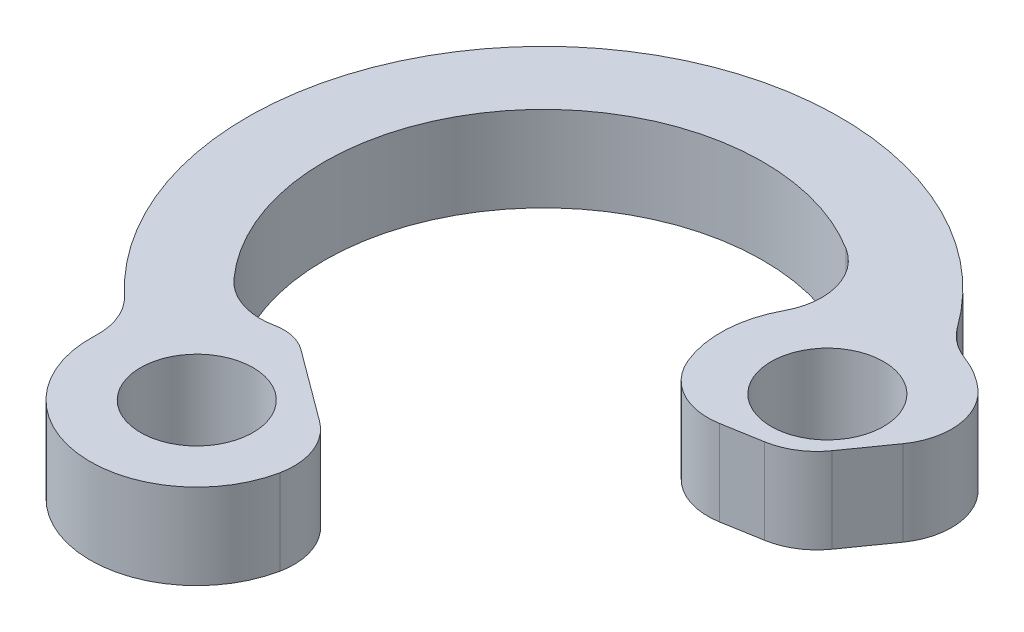
ISO-10303-21;
HEADER;
FILE_DESCRIPTION(('STEP AP214'),'2;1');
FILE_NAME('part.step','',(''),(''),'','','');
FILE_SCHEMA(('AUTOMOTIVE_DESIGN { 1 0 10303 214 1 1 1 1 }'));
ENDSEC;
DATA;
#1=APPLICATION_CONTEXT('core data for automotive mechanical design processes');
#2=APPLICATION_PROTOCOL_DEFINITION('international standard','automotive_design',2000,#1);
#3=PRODUCT_CONTEXT('',#1,'mechanical');
#4=PRODUCT('Part','Part','',(#3));
#5=PRODUCT_RELATED_PRODUCT_CATEGORY('part','',(#4));
#6=PRODUCT_DEFINITION_FORMATION('','',#4);
#7=PRODUCT_DEFINITION_CONTEXT('part definition',#1,'design');
#8=PRODUCT_DEFINITION('design','',#6,#7);
#9=PRODUCT_DEFINITION_SHAPE('','',#8);
#10=(LENGTH_UNIT() NAMED_UNIT(*) SI_UNIT(.MILLI.,.METRE.));
#11=(NAMED_UNIT(*) PLANE_ANGLE_UNIT() SI_UNIT($,.RADIAN.));
#12=(NAMED_UNIT(*) SI_UNIT($,.STERADIAN.) SOLID_ANGLE_UNIT());
#13=UNCERTAINTY_MEASURE_WITH_UNIT(LENGTH_MEASURE(1.E-05),#10,'distance_accuracy_value','');
#14=(GEOMETRIC_REPRESENTATION_CONTEXT(3) GLOBAL_UNCERTAINTY_ASSIGNED_CONTEXT((#13)) GLOBAL_UNIT_ASSIGNED_CONTEXT((#10,
#11,#12)) REPRESENTATION_CONTEXT('',''));
#15=CARTESIAN_POINT('',(0.,0.,0.));
#16=DIRECTION('',(0.,0.,1.));
#17=DIRECTION('',(1.,0.,0.));
#18=AXIS2_PLACEMENT_3D('',#15,#16,#17);
#19=CARTESIAN_POINT('',(70.7257143841729,0.,-73.8122286185501));
#20=DIRECTION('',(0.,1.,0.));
#21=DIRECTION('',(0.,0.,1.));
#22=AXIS2_PLACEMENT_3D('',#19,#20,#21);
#23=CYLINDRICAL_SURFACE('',#22,3.);
#24=CARTESIAN_POINT('',(70.7257143841729,4.,-73.8122286185501));
#25=DIRECTION('',(0.,-1.,0.));
#26=DIRECTION('',(0.,0.,-1.));
#27=AXIS2_PLACEMENT_3D('',#24,#25,#26);
#28=CIRCLE('',#27,3.);
#29=CARTESIAN_POINT('',(71.3263935959705,4.,-70.872979652485));
#30=VERTEX_POINT('',#29);
#31=CARTESIAN_POINT('',(68.4970170332679,4.,-71.8040184407876));
#32=VERTEX_POINT('',#31);
#33=EDGE_CURVE('E183',#30,#32,#28,.T.);
#34=ORIENTED_EDGE('',*,*,#33,.F.);
#35=DIRECTION('',(0.,1.,0.));
#36=VECTOR('',#35,1.);
#37=CARTESIAN_POINT('',(71.3263935959705,0.,-70.872979652485));
#38=LINE('',#37,#36);
#39=CARTESIAN_POINT('',(71.3263935959705,0.,-70.872979652485));
#40=VERTEX_POINT('',#39);
#41=EDGE_CURVE('E11',#40,#30,#38,.T.);
#42=ORIENTED_EDGE('',*,*,#41,.F.);
#43=CARTESIAN_POINT('',(70.7257143841729,0.,-73.8122286185501));
#44=DIRECTION('',(0.,-1.,0.));
#45=DIRECTION('',(0.,0.,-1.));
#46=AXIS2_PLACEMENT_3D('',#43,#44,#45);
#47=CIRCLE('',#46,3.);
#48=CARTESIAN_POINT('',(68.4970170332679,0.,-71.8040184407876));
#49=VERTEX_POINT('',#48);
#50=EDGE_CURVE('E231',#40,#49,#47,.T.);
#51=ORIENTED_EDGE('',*,*,#50,.T.);
#52=DIRECTION('',(0.,1.,0.));
#53=VECTOR('',#52,1.);
#54=CARTESIAN_POINT('',(68.4970170332679,0.,-71.8040184407876));
#55=LINE('',#54,#53);
#56=EDGE_CURVE('E35',#49,#32,#55,.T.);
#57=ORIENTED_EDGE('',*,*,#56,.T.);
#58=EDGE_LOOP('',(#34,#42,#51,#57));
#59=FACE_BOUND('',#58,.T.);
#60=ADVANCED_FACE('F32',(#59),#23,.F.);
#61=CARTESIAN_POINT('',(71.7268464038356,0.,-68.913480341775));
#62=DIRECTION('',(0.,1.,0.));
#63=DIRECTION('',(0.,0.,1.));
#64=AXIS2_PLACEMENT_3D('',#61,#62,#63);
#65=CYLINDRICAL_SURFACE('',#64,2.);
#66=CARTESIAN_POINT('',(71.7268464038356,4.,-68.913480341775));
#67=DIRECTION('',(0.,1.,0.));
#68=DIRECTION('',(0.,0.,1.));
#69=AXIS2_PLACEMENT_3D('',#66,#67,#68);
#70=CIRCLE('',#69,2.);
#71=CARTESIAN_POINT('',(72.9156523362013,4.,-70.5218150255931));
#72=VERTEX_POINT('',#71);
#73=EDGE_CURVE('E229',#72,#30,#70,.T.);
#74=ORIENTED_EDGE('',*,*,#73,.F.);
#75=DIRECTION('',(0.,1.,0.));
#76=VECTOR('',#75,1.);
#77=CARTESIAN_POINT('',(72.9156523362013,0.,-70.5218150255931));
#78=LINE('',#77,#76);
#79=CARTESIAN_POINT('',(72.9156523362013,0.,-70.5218150255931));
#80=VERTEX_POINT('',#79);
#81=EDGE_CURVE('E41',#80,#72,#78,.T.);
#82=ORIENTED_EDGE('',*,*,#81,.F.);
#83=CARTESIAN_POINT('',(71.7268464038356,0.,-68.913480341775));
#84=DIRECTION('',(0.,1.,0.));
#85=DIRECTION('',(0.,0.,1.));
#86=AXIS2_PLACEMENT_3D('',#83,#84,#85);
#87=CIRCLE('',#86,2.);
#88=EDGE_CURVE('E173',#80,#40,#87,.T.);
#89=ORIENTED_EDGE('',*,*,#88,.T.);
#90=ORIENTED_EDGE('',*,*,#41,.T.);
#91=EDGE_LOOP('',(#74,#82,#89,#90));
#92=FACE_BOUND('',#91,.T.);
#93=ADVANCED_FACE('F261',(#92),#65,.T.);
#94=CARTESIAN_POINT('',(76.2816528178536,0.,-68.0338245711221));
#95=DIRECTION('',(0.594402966182842,0.,-0.804167341909033));
#96=DIRECTION('',(-0.804167341909033,0.,-0.594402966182842));
#97=AXIS2_PLACEMENT_3D('',#94,#95,#96);
#98=PLANE('',#97);
#99=DIRECTION('',(-0.804167341909033,0.,-0.594402966182842));
#100=VECTOR('',#99,1.);
#101=CARTESIAN_POINT('',(76.2816528178536,4.,-68.0338245711221));
#102=LINE('',#101,#100);
#103=CARTESIAN_POINT('',(76.2816528178536,4.,-68.0338245711221));
#104=VERTEX_POINT('',#103);
#105=EDGE_CURVE('E160',#104,#72,#102,.T.);
#106=ORIENTED_EDGE('',*,*,#105,.F.);
#107=DIRECTION('',(0.,1.,0.));
#108=VECTOR('',#107,1.);
#109=CARTESIAN_POINT('',(76.2816528178536,0.,-68.0338245711221));
#110=LINE('',#109,#108);
#111=CARTESIAN_POINT('',(76.2816528178536,0.,-68.0338245711221));
#112=VERTEX_POINT('',#111);
#113=EDGE_CURVE('E155',#112,#104,#110,.T.);
#114=ORIENTED_EDGE('',*,*,#113,.F.);
#115=DIRECTION('',(-0.804167341909033,0.,-0.594402966182842));
#116=VECTOR('',#115,1.);
#117=CARTESIAN_POINT('',(76.2816528178536,0.,-68.0338245711221));
#118=LINE('',#117,#116);
#119=EDGE_CURVE('E158',#112,#80,#118,.T.);
#120=ORIENTED_EDGE('',*,*,#119,.T.);
#121=ORIENTED_EDGE('',*,*,#81,.T.);
#122=EDGE_LOOP('',(#106,#114,#120,#121));
#123=FACE_BOUND('',#122,.T.);
#124=ADVANCED_FACE('F157',(#123),#98,.T.);
#125=CARTESIAN_POINT('',(74.4984439193051,0.,-65.621322545395));
#126=DIRECTION('',(0.,1.,0.));
#127=DIRECTION('',(0.,0.,1.));
#128=AXIS2_PLACEMENT_3D('',#125,#126,#127);
#129=CYLINDRICAL_SURFACE('',#128,3.);
#130=CARTESIAN_POINT('',(74.4984439193051,4.,-65.621322545395));
#131=DIRECTION('',(0.,1.,0.));
#132=DIRECTION('',(0.,0.,1.));
#133=AXIS2_PLACEMENT_3D('',#130,#131,#132);
#134=CIRCLE('',#133,3.);
#135=CARTESIAN_POINT('',(77.4381265050103,4.,-65.0227690429395));
#136=VERTEX_POINT('',#135);
#137=EDGE_CURVE('E226',#136,#104,#134,.T.);
#138=ORIENTED_EDGE('',*,*,#137,.F.);
#139=DIRECTION('',(0.,1.,0.));
#140=VECTOR('',#139,1.);
#141=CARTESIAN_POINT('',(77.4381265050103,0.,-65.0227690429395));
#142=LINE('',#141,#140);
#143=CARTESIAN_POINT('',(77.4381265050103,0.,-65.0227690429395));
#144=VERTEX_POINT('',#143);
#145=EDGE_CURVE('E165',#144,#136,#142,.T.);
#146=ORIENTED_EDGE('',*,*,#145,.F.);
#147=CARTESIAN_POINT('',(74.4984439193051,0.,-65.621322545395));
#148=DIRECTION('',(0.,1.,0.));
#149=DIRECTION('',(0.,0.,1.));
#150=AXIS2_PLACEMENT_3D('',#147,#148,#149);
#151=CIRCLE('',#150,3.);
#152=EDGE_CURVE('E171',#144,#112,#151,.T.);
#153=ORIENTED_EDGE('',*,*,#152,.T.);
#154=ORIENTED_EDGE('',*,*,#113,.T.);
#155=EDGE_LOOP('',(#138,#146,#153,#154));
#156=FACE_BOUND('',#155,.T.);
#157=ADVANCED_FACE('F175',(#156),#129,.T.);
#158=CARTESIAN_POINT('',(72.5386555288346,0.,-66.0203582136987));
#159=DIRECTION('',(0.,1.,0.));
#160=DIRECTION('',(0.,0.,1.));
#161=AXIS2_PLACEMENT_3D('',#158,#159,#160);
#162=CYLINDRICAL_SURFACE('',#161,5.00000000000039);
#163=CARTESIAN_POINT('',(72.5386555288346,4.,-66.0203582136987));
#164=DIRECTION('',(0.,1.,0.));
#165=DIRECTION('',(0.,0.,1.));
#166=AXIS2_PLACEMENT_3D('',#163,#164,#165);
#167=CIRCLE('',#166,5.00000000000039);
#168=CARTESIAN_POINT('',(67.5438448545859,4.,-66.2481000157799));
#169=VERTEX_POINT('',#168);
#170=EDGE_CURVE('E223',#169,#136,#167,.T.);
#171=ORIENTED_EDGE('',*,*,#170,.F.);
#172=DIRECTION('',(0.,1.,0.));
#173=VECTOR('',#172,1.);
#174=CARTESIAN_POINT('',(67.5438448545859,0.,-66.2481000157799));
#175=LINE('',#174,#173);
#176=CARTESIAN_POINT('',(67.5438448545859,0.,-66.2481000157799));
#177=VERTEX_POINT('',#176);
#178=EDGE_CURVE('E235',#177,#169,#175,.T.);
#179=ORIENTED_EDGE('',*,*,#178,.F.);
#180=CARTESIAN_POINT('',(72.5386555288346,0.,-66.0203582136987));
#181=DIRECTION('',(0.,1.,0.));
#182=DIRECTION('',(0.,0.,1.));
#183=AXIS2_PLACEMENT_3D('',#180,#181,#182);
#184=CIRCLE('',#183,5.00000000000039);
#185=EDGE_CURVE('E176',#177,#144,#184,.T.);
#186=ORIENTED_EDGE('',*,*,#185,.T.);
#187=ORIENTED_EDGE('',*,*,#145,.T.);
#188=EDGE_LOOP('',(#171,#179,#186,#187));
#189=FACE_BOUND('',#188,.T.);
#190=ADVANCED_FACE('F274',(#189),#162,.T.);
#191=CARTESIAN_POINT('',(64.5469584500369,0.,-66.3847450970286));
#192=DIRECTION('',(0.,1.,0.));
#193=DIRECTION('',(0.,0.,1.));
#194=AXIS2_PLACEMENT_3D('',#191,#192,#193);
#195=CYLINDRICAL_SURFACE('',#194,3.);
#196=CARTESIAN_POINT('',(64.5469584500369,4.,-66.3847450970286));
#197=DIRECTION('',(0.,-1.,0.));
#198=DIRECTION('',(0.,0.,-1.));
#199=AXIS2_PLACEMENT_3D('',#196,#197,#198);
#200=CIRCLE('',#199,3.);
#201=CARTESIAN_POINT('',(66.6039727055924,4.,-68.5684786779494));
#202=VERTEX_POINT('',#201);
#203=EDGE_CURVE('E220',#202,#169,#200,.T.);
#204=ORIENTED_EDGE('',*,*,#203,.F.);
#205=DIRECTION('',(0.,1.,0.));
#206=VECTOR('',#205,1.);
#207=CARTESIAN_POINT('',(66.6039727055924,0.,-68.5684786779494));
#208=LINE('',#207,#206);
#209=CARTESIAN_POINT('',(66.6039727055924,0.,-68.5684786779494));
#210=VERTEX_POINT('',#209);
#211=EDGE_CURVE('E237',#210,#202,#208,.T.);
#212=ORIENTED_EDGE('',*,*,#211,.F.);
#213=CARTESIAN_POINT('',(64.5469584500369,0.,-66.3847450970286));
#214=DIRECTION('',(0.,-1.,0.));
#215=DIRECTION('',(0.,0.,-1.));
#216=AXIS2_PLACEMENT_3D('',#213,#214,#215);
#217=CIRCLE('',#216,3.);
#218=EDGE_CURVE('E178',#210,#177,#217,.T.);
#219=ORIENTED_EDGE('',*,*,#218,.T.);
#220=ORIENTED_EDGE('',*,*,#178,.T.);
#221=EDGE_LOOP('',(#204,#212,#219,#220));
#222=FACE_BOUND('',#221,.T.);
#223=ADVANCED_FACE('F277',(#222),#195,.F.);
#224=CARTESIAN_POINT('',(76.133240695646,0.,-78.6847831494777));
#225=DIRECTION('',(0.,1.,0.));
#226=DIRECTION('',(0.,0.,1.));
#227=AXIS2_PLACEMENT_3D('',#224,#225,#226);
#228=CYLINDRICAL_SURFACE('',#227,13.8977179632817);
#229=CARTESIAN_POINT('',(76.133240695646,4.,-78.6847831494777));
#230=DIRECTION('',(0.,1.,0.));
#231=DIRECTION('',(0.,0.,1.));
#232=AXIS2_PLACEMENT_3D('',#229,#230,#231);
#233=CIRCLE('',#232,13.8977179632817);
#234=CARTESIAN_POINT('',(87.417993221366,4.,-86.7965600830589));
#235=VERTEX_POINT('',#234);
#236=EDGE_CURVE('E217',#235,#202,#233,.T.);
#237=ORIENTED_EDGE('',*,*,#236,.F.);
#238=DIRECTION('',(0.,1.,0.));
#239=VECTOR('',#238,1.);
#240=CARTESIAN_POINT('',(87.417993221366,0.,-86.7965600830589));
#241=LINE('',#240,#239);
#242=CARTESIAN_POINT('',(87.417993221366,0.,-86.7965600830589));
#243=VERTEX_POINT('',#242);
#244=EDGE_CURVE('E239',#243,#235,#241,.T.);
#245=ORIENTED_EDGE('',*,*,#244,.F.);
#246=CARTESIAN_POINT('',(76.133240695646,0.,-78.6847831494777));
#247=DIRECTION('',(0.,1.,0.));
#248=DIRECTION('',(0.,0.,1.));
#249=AXIS2_PLACEMENT_3D('',#246,#247,#248);
#250=CIRCLE('',#249,13.8977179632817);
#251=EDGE_CURVE('E386',#243,#210,#250,.T.);
#252=ORIENTED_EDGE('',*,*,#251,.T.);
#253=ORIENTED_EDGE('',*,*,#211,.T.);
#254=EDGE_LOOP('',(#237,#245,#252,#253));
#255=FACE_BOUND('',#254,.T.);
#256=ADVANCED_FACE('F281',(#255),#228,.T.);
#257=CARTESIAN_POINT('',(89.85395124459,0.,-88.5475907821304));
#258=DIRECTION('',(0.,1.,0.));
#259=DIRECTION('',(0.,0.,1.));
#260=AXIS2_PLACEMENT_3D('',#257,#258,#259);
#261=CYLINDRICAL_SURFACE('',#260,3.);
#262=CARTESIAN_POINT('',(89.85395124459,4.,-88.5475907821304));
#263=DIRECTION('',(0.,-1.,0.));
#264=DIRECTION('',(0.,0.,-1.));
#265=AXIS2_PLACEMENT_3D('',#262,#263,#264);
#266=CIRCLE('',#265,3.);
#267=CARTESIAN_POINT('',(88.8112972998029,4.,-85.7346078899997));
#268=VERTEX_POINT('',#267);
#269=EDGE_CURVE('E214',#268,#235,#266,.T.);
#270=ORIENTED_EDGE('',*,*,#269,.F.);
#271=DIRECTION('',(0.,1.,0.));
#272=VECTOR('',#271,1.);
#273=CARTESIAN_POINT('',(88.8112972998029,0.,-85.7346078899997));
#274=LINE('',#273,#272);
#275=CARTESIAN_POINT('',(88.8112972998029,0.,-85.7346078899997));
#276=VERTEX_POINT('',#275);
#277=EDGE_CURVE('E241',#276,#268,#274,.T.);
#278=ORIENTED_EDGE('',*,*,#277,.F.);
#279=CARTESIAN_POINT('',(89.85395124459,0.,-88.5475907821304));
#280=DIRECTION('',(0.,-1.,0.));
#281=DIRECTION('',(0.,0.,-1.));
#282=AXIS2_PLACEMENT_3D('',#279,#280,#281);
#283=CIRCLE('',#282,3.);
#284=EDGE_CURVE('E383',#276,#243,#283,.T.);
#285=ORIENTED_EDGE('',*,*,#284,.T.);
#286=ORIENTED_EDGE('',*,*,#244,.T.);
#287=EDGE_LOOP('',(#270,#278,#285,#286));
#288=FACE_BOUND('',#287,.T.);
#289=ADVANCED_FACE('F285',(#288),#261,.F.);
#290=CARTESIAN_POINT('',(87.0735407251576,0.,-81.0463030697812));
#291=DIRECTION('',(0.,1.,0.));
#292=DIRECTION('',(0.,0.,1.));
#293=AXIS2_PLACEMENT_3D('',#290,#291,#292);
#294=CYLINDRICAL_SURFACE('',#293,5.00000000000075);
#295=CARTESIAN_POINT('',(87.0735407251576,4.,-81.0463030697812));
#296=DIRECTION('',(0.,1.,0.));
#297=DIRECTION('',(0.,0.,1.));
#298=AXIS2_PLACEMENT_3D('',#295,#296,#297);
#299=CIRCLE('',#298,5.00000000000075);
#300=CARTESIAN_POINT('',(90.4170132830894,4.,-84.7639893468041));
#301=VERTEX_POINT('',#300);
#302=EDGE_CURVE('E211',#301,#268,#299,.T.);
#303=ORIENTED_EDGE('',*,*,#302,.F.);
#304=DIRECTION('',(0.,1.,0.));
#305=VECTOR('',#304,1.);
#306=CARTESIAN_POINT('',(90.4170132830894,0.,-84.7639893468041));
#307=LINE('',#306,#305);
#308=CARTESIAN_POINT('',(90.4170132830894,0.,-84.7639893468041));
#309=VERTEX_POINT('',#308);
#310=EDGE_CURVE('E243',#309,#301,#307,.T.);
#311=ORIENTED_EDGE('',*,*,#310,.F.);
#312=CARTESIAN_POINT('',(87.0735407251576,0.,-81.0463030697812));
#313=DIRECTION('',(0.,1.,0.));
#314=DIRECTION('',(0.,0.,1.));
#315=AXIS2_PLACEMENT_3D('',#312,#313,#314);
#316=CIRCLE('',#315,5.00000000000075);
#317=EDGE_CURVE('E380',#309,#276,#316,.T.);
#318=ORIENTED_EDGE('',*,*,#317,.T.);
#319=ORIENTED_EDGE('',*,*,#277,.T.);
#320=EDGE_LOOP('',(#303,#311,#318,#319));
#321=FACE_BOUND('',#320,.T.);
#322=ADVANCED_FACE('F289',(#321),#294,.T.);
#323=CARTESIAN_POINT('',(88.4109297483306,0.,-82.5333775805907));
#324=DIRECTION('',(0.,1.,0.));
#325=DIRECTION('',(0.,0.,1.));
#326=AXIS2_PLACEMENT_3D('',#323,#324,#325);
#327=CYLINDRICAL_SURFACE('',#326,3.00000000000001);
#328=CARTESIAN_POINT('',(88.4109297483306,4.,-82.5333775805907));
#329=DIRECTION('',(0.,1.,0.));
#330=DIRECTION('',(0.,0.,1.));
#331=AXIS2_PLACEMENT_3D('',#328,#329,#330);
#332=CIRCLE('',#331,3.00000000000001);
#333=CARTESIAN_POINT('',(90.8599078164376,4.,-80.8006033823955));
#334=VERTEX_POINT('',#333);
#335=EDGE_CURVE('E208',#334,#301,#332,.T.);
#336=ORIENTED_EDGE('',*,*,#335,.F.);
#337=DIRECTION('',(0.,1.,0.));
#338=VECTOR('',#337,1.);
#339=CARTESIAN_POINT('',(90.8599078164376,0.,-80.8006033823955));
#340=LINE('',#339,#338);
#341=CARTESIAN_POINT('',(90.8599078164376,0.,-80.8006033823955));
#342=VERTEX_POINT('',#341);
#343=EDGE_CURVE('E245',#342,#334,#340,.T.);
#344=ORIENTED_EDGE('',*,*,#343,.F.);
#345=CARTESIAN_POINT('',(88.4109297483306,0.,-82.5333775805907));
#346=DIRECTION('',(0.,1.,0.));
#347=DIRECTION('',(0.,0.,1.));
#348=AXIS2_PLACEMENT_3D('',#345,#346,#347);
#349=CIRCLE('',#348,3.00000000000001);
#350=EDGE_CURVE('E377',#342,#309,#349,.T.);
#351=ORIENTED_EDGE('',*,*,#350,.T.);
#352=ORIENTED_EDGE('',*,*,#310,.T.);
#353=EDGE_LOOP('',(#336,#344,#351,#352));
#354=FACE_BOUND('',#353,.T.);
#355=ADVANCED_FACE('F293',(#354),#327,.T.);
#356=CARTESIAN_POINT('',(89.4867256076961,0.,-78.8598466950986));
#357=DIRECTION('',(0.816326022702334,0.,0.577591399398389));
#358=DIRECTION('',(0.577591399398389,0.,-0.816326022702334));
#359=AXIS2_PLACEMENT_3D('',#356,#357,#358);
#360=PLANE('',#359);
#361=DIRECTION('',(0.577591399398389,0.,-0.816326022702334));
#362=VECTOR('',#361,1.);
#363=CARTESIAN_POINT('',(89.4867256076961,4.,-78.8598466950986));
#364=LINE('',#363,#362);
#365=CARTESIAN_POINT('',(89.4867256076961,4.,-78.8598466950986));
#366=VERTEX_POINT('',#365);
#367=EDGE_CURVE('E205',#366,#334,#364,.T.);
#368=ORIENTED_EDGE('',*,*,#367,.F.);
#369=DIRECTION('',(0.,1.,0.));
#370=VECTOR('',#369,1.);
#371=CARTESIAN_POINT('',(89.4867256076961,0.,-78.8598466950986));
#372=LINE('',#371,#370);
#373=CARTESIAN_POINT('',(89.4867256076961,0.,-78.8598466950986));
#374=VERTEX_POINT('',#373);
#375=EDGE_CURVE('E247',#374,#366,#372,.T.);
#376=ORIENTED_EDGE('',*,*,#375,.F.);
#377=DIRECTION('',(0.577591399398389,0.,-0.816326022702334));
#378=VECTOR('',#377,1.);
#379=CARTESIAN_POINT('',(89.4867256076961,0.,-78.8598466950986));
#380=LINE('',#379,#378);
#381=EDGE_CURVE('E374',#374,#342,#380,.T.);
#382=ORIENTED_EDGE('',*,*,#381,.T.);
#383=ORIENTED_EDGE('',*,*,#343,.T.);
#384=EDGE_LOOP('',(#368,#376,#382,#383));
#385=FACE_BOUND('',#384,.T.);
#386=ADVANCED_FACE('F297',(#385),#360,.T.);
#387=CARTESIAN_POINT('',(87.0377475395891,0.,-80.5926208932938));
#388=DIRECTION('',(0.,1.,0.));
#389=DIRECTION('',(0.,0.,1.));
#390=AXIS2_PLACEMENT_3D('',#387,#388,#389);
#391=CYLINDRICAL_SURFACE('',#390,3.);
#392=CARTESIAN_POINT('',(87.0377475395891,4.,-80.5926208932938));
#393=DIRECTION('',(0.,1.,0.));
#394=DIRECTION('',(0.,0.,1.));
#395=AXIS2_PLACEMENT_3D('',#392,#393,#394);
#396=CIRCLE('',#395,3.);
#397=CARTESIAN_POINT('',(87.5472284238912,4.,-77.636199200008));
#398=VERTEX_POINT('',#397);
#399=EDGE_CURVE('E202',#398,#366,#396,.T.);
#400=ORIENTED_EDGE('',*,*,#399,.F.);
#401=DIRECTION('',(0.,1.,0.));
#402=VECTOR('',#401,1.);
#403=CARTESIAN_POINT('',(87.5472284238912,0.,-77.636199200008));
#404=LINE('',#403,#402);
#405=CARTESIAN_POINT('',(87.5472284238912,0.,-77.636199200008));
#406=VERTEX_POINT('',#405);
#407=EDGE_CURVE('E249',#406,#398,#404,.T.);
#408=ORIENTED_EDGE('',*,*,#407,.F.);
#409=CARTESIAN_POINT('',(87.0377475395891,0.,-80.5926208932938));
#410=DIRECTION('',(0.,1.,0.));
#411=DIRECTION('',(0.,0.,1.));
#412=AXIS2_PLACEMENT_3D('',#409,#410,#411);
#413=CIRCLE('',#412,3.);
#414=EDGE_CURVE('E371',#406,#374,#413,.T.);
#415=ORIENTED_EDGE('',*,*,#414,.T.);
#416=ORIENTED_EDGE('',*,*,#375,.T.);
#417=EDGE_LOOP('',(#400,#408,#415,#416));
#418=FACE_BOUND('',#417,.T.);
#419=ADVANCED_FACE('F301',(#418),#391,.T.);
#420=CARTESIAN_POINT('',(85.7354837120089,0.,-77.3239807840643));
#421=DIRECTION('',(0.169826961434026,0.,0.985473897761928));
#422=DIRECTION('',(0.985473897761928,0.,-0.169826961434026));
#423=AXIS2_PLACEMENT_3D('',#420,#421,#422);
#424=PLANE('',#423);
#425=DIRECTION('',(0.985473897761927,0.,-0.169826961434026));
#426=VECTOR('',#425,1.);
#427=CARTESIAN_POINT('',(85.7354837120089,4.,-77.3239807840643));
#428=LINE('',#427,#426);
#429=CARTESIAN_POINT('',(85.7354837120089,4.,-77.3239807840643));
#430=VERTEX_POINT('',#429);
#431=EDGE_CURVE('E199',#430,#398,#428,.T.);
#432=ORIENTED_EDGE('',*,*,#431,.F.);
#433=DIRECTION('',(0.,1.,0.));
#434=VECTOR('',#433,1.);
#435=CARTESIAN_POINT('',(85.7354837120089,0.,-77.3239807840643));
#436=LINE('',#435,#434);
#437=CARTESIAN_POINT('',(85.7354837120089,0.,-77.3239807840643));
#438=VERTEX_POINT('',#437);
#439=EDGE_CURVE('E251',#438,#430,#436,.T.);
#440=ORIENTED_EDGE('',*,*,#439,.F.);
#441=DIRECTION('',(0.985473897761927,0.,-0.169826961434026));
#442=VECTOR('',#441,1.);
#443=CARTESIAN_POINT('',(85.7354837120089,0.,-77.3239807840643));
#444=LINE('',#443,#442);
#445=EDGE_CURVE('E368',#438,#406,#444,.T.);
#446=ORIENTED_EDGE('',*,*,#445,.T.);
#447=ORIENTED_EDGE('',*,*,#407,.T.);
#448=EDGE_LOOP('',(#432,#440,#446,#447));
#449=FACE_BOUND('',#448,.T.);
#450=ADVANCED_FACE('F305',(#449),#424,.T.);
#451=CARTESIAN_POINT('',(85.2260028277068,0.,-80.2804024773501));
#452=DIRECTION('',(0.,1.,0.));
#453=DIRECTION('',(0.,0.,1.));
#454=AXIS2_PLACEMENT_3D('',#451,#452,#453);
#455=CYLINDRICAL_SURFACE('',#454,3.);
#456=CARTESIAN_POINT('',(85.2260028277068,4.,-80.2804024773501));
#457=DIRECTION('',(0.,1.,0.));
#458=DIRECTION('',(0.,0.,1.));
#459=AXIS2_PLACEMENT_3D('',#456,#457,#458);
#460=CIRCLE('',#459,3.);
#461=CARTESIAN_POINT('',(82.4546959815318,4.,-79.1315515887038));
#462=VERTEX_POINT('',#461);
#463=EDGE_CURVE('E196',#462,#430,#460,.T.);
#464=ORIENTED_EDGE('',*,*,#463,.F.);
#465=DIRECTION('',(0.,1.,0.));
#466=VECTOR('',#465,1.);
#467=CARTESIAN_POINT('',(82.4546959815318,0.,-79.1315515887038));
#468=LINE('',#467,#466);
#469=CARTESIAN_POINT('',(82.4546959815318,0.,-79.1315515887038));
#470=VERTEX_POINT('',#469);
#471=EDGE_CURVE('E253',#470,#462,#468,.T.);
#472=ORIENTED_EDGE('',*,*,#471,.F.);
#473=CARTESIAN_POINT('',(85.2260028277068,0.,-80.2804024773501));
#474=DIRECTION('',(0.,1.,0.));
#475=DIRECTION('',(0.,0.,1.));
#476=AXIS2_PLACEMENT_3D('',#473,#474,#475);
#477=CIRCLE('',#476,3.);
#478=EDGE_CURVE('E365',#470,#438,#477,.T.);
#479=ORIENTED_EDGE('',*,*,#478,.T.);
#480=ORIENTED_EDGE('',*,*,#439,.T.);
#481=EDGE_LOOP('',(#464,#472,#479,#480));
#482=FACE_BOUND('',#481,.T.);
#483=ADVANCED_FACE('F309',(#482),#455,.T.);
#484=CARTESIAN_POINT('',(87.0735407251576,0.,-81.0463030697812));
#485=DIRECTION('',(0.,1.,0.));
#486=DIRECTION('',(0.,0.,1.));
#487=AXIS2_PLACEMENT_3D('',#484,#485,#486);
#488=CYLINDRICAL_SURFACE('',#487,5.00000000000075);
#489=CARTESIAN_POINT('',(87.0735407251576,4.,-81.0463030697812));
#490=DIRECTION('',(0.,1.,0.));
#491=DIRECTION('',(0.,0.,1.));
#492=AXIS2_PLACEMENT_3D('',#489,#490,#491);
#493=CIRCLE('',#492,5.00000000000075);
#494=CARTESIAN_POINT('',(82.6696468529793,4.,-83.4139429838302));
#495=VERTEX_POINT('',#494);
#496=EDGE_CURVE('E193',#495,#462,#493,.T.);
#497=ORIENTED_EDGE('',*,*,#496,.F.);
#498=DIRECTION('',(0.,1.,0.));
#499=VECTOR('',#498,1.);
#500=CARTESIAN_POINT('',(82.6696468529793,0.,-83.4139429838302));
#501=LINE('',#500,#499);
#502=CARTESIAN_POINT('',(82.6696468529793,0.,-83.4139429838302));
#503=VERTEX_POINT('',#502);
#504=EDGE_CURVE('E255',#503,#495,#501,.T.);
#505=ORIENTED_EDGE('',*,*,#504,.F.);
#506=CARTESIAN_POINT('',(87.0735407251576,0.,-81.0463030697812));
#507=DIRECTION('',(0.,1.,0.));
#508=DIRECTION('',(0.,0.,1.));
#509=AXIS2_PLACEMENT_3D('',#506,#507,#508);
#510=CIRCLE('',#509,5.00000000000075);
#511=EDGE_CURVE('E362',#503,#470,#510,.T.);
#512=ORIENTED_EDGE('',*,*,#511,.T.);
#513=ORIENTED_EDGE('',*,*,#471,.T.);
#514=EDGE_LOOP('',(#497,#505,#512,#513));
#515=FACE_BOUND('',#514,.T.);
#516=ADVANCED_FACE('F313',(#515),#488,.T.);
#517=CARTESIAN_POINT('',(80.0273105296727,0.,-84.8345269322593));
#518=DIRECTION('',(0.,1.,0.));
#519=DIRECTION('',(0.,0.,1.));
#520=AXIS2_PLACEMENT_3D('',#517,#518,#519);
#521=CYLINDRICAL_SURFACE('',#520,3.);
#522=CARTESIAN_POINT('',(80.0273105296727,4.,-84.8345269322593));
#523=DIRECTION('',(0.,-1.,0.));
#524=DIRECTION('',(0.,0.,-1.));
#525=AXIS2_PLACEMENT_3D('',#522,#523,#524);
#526=CIRCLE('',#525,3.);
#527=CARTESIAN_POINT('',(81.6322408847818,4.,-87.3691272074999));
#528=VERTEX_POINT('',#527);
#529=EDGE_CURVE('E190',#528,#495,#526,.T.);
#530=ORIENTED_EDGE('',*,*,#529,.F.);
#531=DIRECTION('',(0.,1.,0.));
#532=VECTOR('',#531,1.);
#533=CARTESIAN_POINT('',(81.6322408847818,0.,-87.3691272074999));
#534=LINE('',#533,#532);
#535=CARTESIAN_POINT('',(81.6322408847818,0.,-87.3691272074999));
#536=VERTEX_POINT('',#535);
#537=EDGE_CURVE('E256',#536,#528,#534,.T.);
#538=ORIENTED_EDGE('',*,*,#537,.F.);
#539=CARTESIAN_POINT('',(80.0273105296727,0.,-84.8345269322593));
#540=DIRECTION('',(0.,-1.,0.));
#541=DIRECTION('',(0.,0.,-1.));
#542=AXIS2_PLACEMENT_3D('',#539,#540,#541);
#543=CIRCLE('',#542,3.);
#544=EDGE_CURVE('E359',#536,#503,#543,.T.);
#545=ORIENTED_EDGE('',*,*,#544,.T.);
#546=ORIENTED_EDGE('',*,*,#504,.T.);
#547=EDGE_LOOP('',(#530,#538,#545,#546));
#548=FACE_BOUND('',#547,.T.);
#549=ADVANCED_FACE('F317',(#548),#521,.F.);
#550=CARTESIAN_POINT('',(76.133240695646,0.,-78.6847831494777));
#551=DIRECTION('',(0.,1.,0.));
#552=DIRECTION('',(0.,0.,1.));
#553=AXIS2_PLACEMENT_3D('',#550,#551,#552);
#554=CYLINDRICAL_SURFACE('',#553,10.278951055347);
#555=CARTESIAN_POINT('',(76.133240695646,4.,-78.6847831494777));
#556=DIRECTION('',(0.,-1.,0.));
#557=DIRECTION('',(0.,0.,-1.));
#558=AXIS2_PLACEMENT_3D('',#555,#556,#557);
#559=CIRCLE('',#558,10.278951055347);
#560=EDGE_CURVE('E186',#32,#528,#559,.T.);
#561=ORIENTED_EDGE('',*,*,#560,.F.);
#562=ORIENTED_EDGE('',*,*,#56,.F.);
#563=CARTESIAN_POINT('',(76.133240695646,0.,-78.6847831494777));
#564=DIRECTION('',(0.,-1.,0.));
#565=DIRECTION('',(0.,0.,-1.));
#566=AXIS2_PLACEMENT_3D('',#563,#564,#565);
#567=CIRCLE('',#566,10.278951055347);
#568=EDGE_CURVE('E357',#49,#536,#567,.T.);
#569=ORIENTED_EDGE('',*,*,#568,.T.);
#570=ORIENTED_EDGE('',*,*,#537,.T.);
#571=EDGE_LOOP('',(#561,#562,#569,#570));
#572=FACE_BOUND('',#571,.T.);
#573=ADVANCED_FACE('F258',(#572),#554,.F.);
#574=CARTESIAN_POINT('',(70.7257143841729,0.,-73.8122286185501));
#575=DIRECTION('',(0.,-1.,0.));
#576=DIRECTION('',(0.,0.,-1.));
#577=AXIS2_PLACEMENT_3D('',#574,#575,#576);
#578=PLANE('',#577);
#579=CARTESIAN_POINT('',(87.0735407251576,0.,-81.0463030697812));
#580=DIRECTION('',(0.,1.,0.));
#581=DIRECTION('',(0.,0.,-1.));
#582=AXIS2_PLACEMENT_3D('',#579,#580,#581);
#583=CIRCLE('',#582,2.6375);
#584=CARTESIAN_POINT('',(87.0735407251576,0.,-83.6838030697812));
#585=VERTEX_POINT('',#584);
#586=EDGE_CURVE('E344',#585,#585,#583,.T.);
#587=ORIENTED_EDGE('',*,*,#586,.T.);
#588=EDGE_LOOP('',(#587));
#589=FACE_BOUND('',#588,.T.);
#590=CARTESIAN_POINT('',(72.5386555288346,0.,-66.0203582136987));
#591=DIRECTION('',(0.,1.,0.));
#592=DIRECTION('',(0.,0.,-1.));
#593=AXIS2_PLACEMENT_3D('',#590,#591,#592);
#594=CIRCLE('',#593,2.6375);
#595=CARTESIAN_POINT('',(72.5386555288346,0.,-68.6578582136987));
#596=VERTEX_POINT('',#595);
#597=EDGE_CURVE('E187',#596,#596,#594,.T.);
#598=ORIENTED_EDGE('',*,*,#597,.T.);
#599=EDGE_LOOP('',(#598));
#600=FACE_BOUND('',#599,.T.);
#601=ORIENTED_EDGE('',*,*,#50,.F.);
#602=ORIENTED_EDGE('',*,*,#88,.F.);
#603=ORIENTED_EDGE('',*,*,#119,.F.);
#604=ORIENTED_EDGE('',*,*,#152,.F.);
#605=ORIENTED_EDGE('',*,*,#185,.F.);
#606=ORIENTED_EDGE('',*,*,#218,.F.);
#607=ORIENTED_EDGE('',*,*,#251,.F.);
#608=ORIENTED_EDGE('',*,*,#284,.F.);
#609=ORIENTED_EDGE('',*,*,#317,.F.);
#610=ORIENTED_EDGE('',*,*,#350,.F.);
#611=ORIENTED_EDGE('',*,*,#381,.F.);
#612=ORIENTED_EDGE('',*,*,#414,.F.);
#613=ORIENTED_EDGE('',*,*,#445,.F.);
#614=ORIENTED_EDGE('',*,*,#478,.F.);
#615=ORIENTED_EDGE('',*,*,#511,.F.);
#616=ORIENTED_EDGE('',*,*,#544,.F.);
#617=ORIENTED_EDGE('',*,*,#568,.F.);
#618=EDGE_LOOP('',(#601,#602,#603,#604,#605,#606,#607,#608,#609,#610,#611,#612,#613,#614,#615,
#616,#617));
#619=FACE_BOUND('',#618,.T.);
#620=ADVANCED_FACE('F169',(#589,#600,#619),#578,.T.);
#621=CARTESIAN_POINT('',(70.7257143841729,4.,-73.8122286185501));
#622=DIRECTION('',(0.,-1.,0.));
#623=DIRECTION('',(0.,0.,-1.));
#624=AXIS2_PLACEMENT_3D('',#621,#622,#623);
#625=PLANE('',#624);
#626=CARTESIAN_POINT('',(87.0735407251576,4.,-81.0463030697812));
#627=DIRECTION('',(0.,1.,0.));
#628=DIRECTION('',(0.,0.,-1.));
#629=AXIS2_PLACEMENT_3D('',#626,#627,#628);
#630=CIRCLE('',#629,2.6375);
#631=CARTESIAN_POINT('',(87.0735407251576,4.,-83.6838030697812));
#632=VERTEX_POINT('',#631);
#633=EDGE_CURVE('E347',#632,#632,#630,.T.);
#634=ORIENTED_EDGE('',*,*,#633,.F.);
#635=EDGE_LOOP('',(#634));
#636=FACE_BOUND('',#635,.T.);
#637=CARTESIAN_POINT('',(72.5386555288346,4.,-66.0203582136987));
#638=DIRECTION('',(0.,1.,0.));
#639=DIRECTION('',(0.,0.,-1.));
#640=AXIS2_PLACEMENT_3D('',#637,#638,#639);
#641=CIRCLE('',#640,2.6375);
#642=CARTESIAN_POINT('',(72.5386555288346,4.,-68.6578582136987));
#643=VERTEX_POINT('',#642);
#644=EDGE_CURVE('E349',#643,#643,#641,.T.);
#645=ORIENTED_EDGE('',*,*,#644,.F.);
#646=EDGE_LOOP('',(#645));
#647=FACE_BOUND('',#646,.T.);
#648=ORIENTED_EDGE('',*,*,#33,.T.);
#649=ORIENTED_EDGE('',*,*,#560,.T.);
#650=ORIENTED_EDGE('',*,*,#529,.T.);
#651=ORIENTED_EDGE('',*,*,#496,.T.);
#652=ORIENTED_EDGE('',*,*,#463,.T.);
#653=ORIENTED_EDGE('',*,*,#431,.T.);
#654=ORIENTED_EDGE('',*,*,#399,.T.);
#655=ORIENTED_EDGE('',*,*,#367,.T.);
#656=ORIENTED_EDGE('',*,*,#335,.T.);
#657=ORIENTED_EDGE('',*,*,#302,.T.);
#658=ORIENTED_EDGE('',*,*,#269,.T.);
#659=ORIENTED_EDGE('',*,*,#236,.T.);
#660=ORIENTED_EDGE('',*,*,#203,.T.);
#661=ORIENTED_EDGE('',*,*,#170,.T.);
#662=ORIENTED_EDGE('',*,*,#137,.T.);
#663=ORIENTED_EDGE('',*,*,#105,.T.);
#664=ORIENTED_EDGE('',*,*,#73,.T.);
#665=EDGE_LOOP('',(#648,#649,#650,#651,#652,#653,#654,#655,#656,#657,#658,#659,#660,#661,#662,
#663,#664));
#666=FACE_BOUND('',#665,.T.);
#667=ADVANCED_FACE('F260',(#636,#647,#666),#625,.F.);
#668=CARTESIAN_POINT('',(72.5386555288346,0.,-66.0203582136987));
#669=DIRECTION('',(0.,1.,0.));
#670=DIRECTION('',(0.,0.,1.));
#671=AXIS2_PLACEMENT_3D('',#668,#669,#670);
#672=CYLINDRICAL_SURFACE('',#671,2.6375);
#673=ORIENTED_EDGE('',*,*,#597,.F.);
#674=EDGE_LOOP('',(#673));
#675=FACE_BOUND('',#674,.T.);
#676=ORIENTED_EDGE('',*,*,#644,.T.);
#677=EDGE_LOOP('',(#676));
#678=FACE_BOUND('',#677,.T.);
#679=ADVANCED_FACE('F329',(#675,#678),#672,.F.);
#680=CARTESIAN_POINT('',(87.0735407251576,0.,-81.0463030697812));
#681=DIRECTION('',(0.,1.,0.));
#682=DIRECTION('',(0.,0.,1.));
#683=AXIS2_PLACEMENT_3D('',#680,#681,#682);
#684=CYLINDRICAL_SURFACE('',#683,2.6375);
#685=ORIENTED_EDGE('',*,*,#586,.F.);
#686=EDGE_LOOP('',(#685));
#687=FACE_BOUND('',#686,.T.);
#688=ORIENTED_EDGE('',*,*,#633,.T.);
#689=EDGE_LOOP('',(#688));
#690=FACE_BOUND('',#689,.T.);
#691=ADVANCED_FACE('F336',(#687,#690),#684,.F.);
#692=CLOSED_SHELL('',(#60,#93,#124,#157,#190,#223,#256,#289,#322,#355,#386,#419,#450,#483,#516,
#549,#573,#620,#667,#679,#691));
#693=MANIFOLD_SOLID_BREP('B2',#692);
#694=ADVANCED_BREP_SHAPE_REPRESENTATION('',(#18,#693),#14);
#695=SHAPE_DEFINITION_REPRESENTATION(#9,#694);
ENDSEC;
END-ISO-10303-21;
